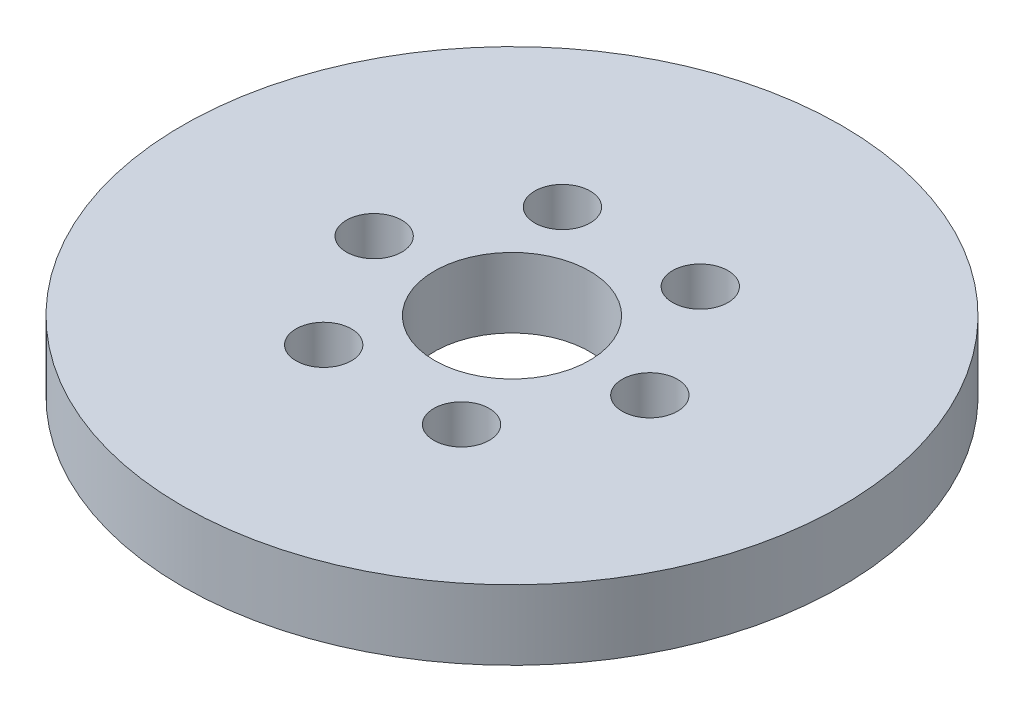
ISO-10303-21;
HEADER;
FILE_DESCRIPTION(('STEP AP214'),'2;1');
FILE_NAME('part.step','',(''),(''),'','','');
FILE_SCHEMA(('AUTOMOTIVE_DESIGN { 1 0 10303 214 1 1 1 1 }'));
ENDSEC;
DATA;
#1=APPLICATION_CONTEXT('core data for automotive mechanical design processes');
#2=APPLICATION_PROTOCOL_DEFINITION('international standard','automotive_design',2000,#1);
#3=PRODUCT_CONTEXT('',#1,'mechanical');
#4=PRODUCT('Part','Part','',(#3));
#5=PRODUCT_RELATED_PRODUCT_CATEGORY('part','',(#4));
#6=PRODUCT_DEFINITION_FORMATION('','',#4);
#7=PRODUCT_DEFINITION_CONTEXT('part definition',#1,'design');
#8=PRODUCT_DEFINITION('design','',#6,#7);
#9=PRODUCT_DEFINITION_SHAPE('','',#8);
#10=(LENGTH_UNIT() NAMED_UNIT(*) SI_UNIT(.MILLI.,.METRE.));
#11=(NAMED_UNIT(*) PLANE_ANGLE_UNIT() SI_UNIT($,.RADIAN.));
#12=(NAMED_UNIT(*) SI_UNIT($,.STERADIAN.) SOLID_ANGLE_UNIT());
#13=UNCERTAINTY_MEASURE_WITH_UNIT(LENGTH_MEASURE(1.E-05),#10,'distance_accuracy_value','');
#14=(GEOMETRIC_REPRESENTATION_CONTEXT(3) GLOBAL_UNCERTAINTY_ASSIGNED_CONTEXT((#13)) GLOBAL_UNIT_ASSIGNED_CONTEXT((#10,
#11,#12)) REPRESENTATION_CONTEXT('',''));
#15=CARTESIAN_POINT('',(0.,0.,0.));
#16=DIRECTION('',(0.,0.,1.));
#17=DIRECTION('',(1.,0.,0.));
#18=AXIS2_PLACEMENT_3D('',#15,#16,#17);
#19=CARTESIAN_POINT('',(0.,18.,0.));
#20=DIRECTION('',(0.,-1.,0.));
#21=DIRECTION('',(0.,0.,-1.));
#22=AXIS2_PLACEMENT_3D('',#19,#20,#21);
#23=CYLINDRICAL_SURFACE('',#22,85.);
#24=CARTESIAN_POINT('',(0.,18.,0.));
#25=DIRECTION('',(0.,1.,0.));
#26=DIRECTION('',(0.,0.,1.));
#27=AXIS2_PLACEMENT_3D('',#24,#25,#26);
#28=CIRCLE('',#27,85.);
#29=CARTESIAN_POINT('',(0.,18.,85.));
#30=VERTEX_POINT('',#29);
#31=EDGE_CURVE('E10',#30,#30,#28,.T.);
#32=ORIENTED_EDGE('',*,*,#31,.F.);
#33=EDGE_LOOP('',(#32));
#34=FACE_BOUND('',#33,.T.);
#35=CARTESIAN_POINT('',(0.,0.,0.));
#36=DIRECTION('',(0.,1.,0.));
#37=DIRECTION('',(0.,0.,1.));
#38=AXIS2_PLACEMENT_3D('',#35,#36,#37);
#39=CIRCLE('',#38,85.);
#40=CARTESIAN_POINT('',(0.,0.,85.));
#41=VERTEX_POINT('',#40);
#42=EDGE_CURVE('E37',#41,#41,#39,.T.);
#43=ORIENTED_EDGE('',*,*,#42,.T.);
#44=EDGE_LOOP('',(#43));
#45=FACE_BOUND('',#44,.T.);
#46=ADVANCED_FACE('F40',(#34,#45),#23,.T.);
#47=CARTESIAN_POINT('',(0.,18.,0.));
#48=DIRECTION('',(0.,1.,0.));
#49=DIRECTION('',(0.,0.,1.));
#50=AXIS2_PLACEMENT_3D('',#47,#48,#49);
#51=PLANE('',#50);
#52=CARTESIAN_POINT('',(-17.7756832143866,18.,-30.788386466566));
#53=DIRECTION('',(0.,1.,0.));
#54=DIRECTION('',(-0.866025403784433,0.,0.50000000000001));
#55=AXIS2_PLACEMENT_3D('',#52,#53,#54);
#56=CIRCLE('',#55,7.14801269062768);
#57=CARTESIAN_POINT('',(-17.7756832143866,18.,-23.6403737759383));
#58=VERTEX_POINT('',#57);
#59=EDGE_CURVE('E70',#58,#58,#56,.T.);
#60=ORIENTED_EDGE('',*,*,#59,.F.);
#61=EDGE_LOOP('',(#60));
#62=FACE_BOUND('',#61,.T.);
#63=CARTESIAN_POINT('',(17.775683214386,18.,-30.7883864665664));
#64=DIRECTION('',(0.,1.,0.));
#65=DIRECTION('',(-0.866025403784443,0.,-0.499999999999992));
#66=AXIS2_PLACEMENT_3D('',#63,#64,#65);
#67=CIRCLE('',#66,7.14801269062768);
#68=CARTESIAN_POINT('',(17.775683214386,18.,-23.6403737759387));
#69=VERTEX_POINT('',#68);
#70=EDGE_CURVE('E71',#69,#69,#67,.T.);
#71=ORIENTED_EDGE('',*,*,#70,.F.);
#72=EDGE_LOOP('',(#71));
#73=FACE_BOUND('',#72,.T.);
#74=CARTESIAN_POINT('',(35.5513664287725,18.,0.));
#75=DIRECTION('',(0.,1.,0.));
#76=DIRECTION('',(0.,0.,-1.));
#77=AXIS2_PLACEMENT_3D('',#74,#75,#76);
#78=CIRCLE('',#77,7.14801269062768);
#79=CARTESIAN_POINT('',(35.5513664287725,18.,7.14801269062768));
#80=VERTEX_POINT('',#79);
#81=EDGE_CURVE('E78',#80,#80,#78,.T.);
#82=ORIENTED_EDGE('',*,*,#81,.F.);
#83=EDGE_LOOP('',(#82));
#84=FACE_BOUND('',#83,.T.);
#85=CARTESIAN_POINT('',(17.7756832143864,18.,30.7883864665662));
#86=DIRECTION('',(0.,1.,0.));
#87=DIRECTION('',(0.866025403784436,0.,-0.500000000000004));
#88=AXIS2_PLACEMENT_3D('',#85,#86,#87);
#89=CIRCLE('',#88,7.14801269062768);
#90=CARTESIAN_POINT('',(17.7756832143864,18.,37.9363991571938));
#91=VERTEX_POINT('',#90);
#92=EDGE_CURVE('E84',#91,#91,#89,.T.);
#93=ORIENTED_EDGE('',*,*,#92,.F.);
#94=EDGE_LOOP('',(#93));
#95=FACE_BOUND('',#94,.T.);
#96=CARTESIAN_POINT('',(-17.7756832143862,18.,30.7883864665663));
#97=DIRECTION('',(0.,1.,0.));
#98=DIRECTION('',(0.86602540378444,0.,0.499999999999998));
#99=AXIS2_PLACEMENT_3D('',#96,#97,#98);
#100=CIRCLE('',#99,7.14801269062768);
#101=CARTESIAN_POINT('',(-17.7756832143862,18.,37.9363991571939));
#102=VERTEX_POINT('',#101);
#103=EDGE_CURVE('E61',#102,#102,#100,.T.);
#104=ORIENTED_EDGE('',*,*,#103,.F.);
#105=EDGE_LOOP('',(#104));
#106=FACE_BOUND('',#105,.T.);
#107=CARTESIAN_POINT('',(-35.5513664287725,18.,0.));
#108=DIRECTION('',(0.,1.,0.));
#109=DIRECTION('',(0.,0.,1.));
#110=AXIS2_PLACEMENT_3D('',#107,#108,#109);
#111=CIRCLE('',#110,7.14801269062768);
#112=CARTESIAN_POINT('',(-35.5513664287725,18.,7.14801269062768));
#113=VERTEX_POINT('',#112);
#114=EDGE_CURVE('E54',#113,#113,#111,.T.);
#115=ORIENTED_EDGE('',*,*,#114,.F.);
#116=EDGE_LOOP('',(#115));
#117=FACE_BOUND('',#116,.T.);
#118=CARTESIAN_POINT('',(0.,18.,0.));
#119=DIRECTION('',(0.,1.,0.));
#120=DIRECTION('',(0.,0.,1.));
#121=AXIS2_PLACEMENT_3D('',#118,#119,#120);
#122=CIRCLE('',#121,20.);
#123=CARTESIAN_POINT('',(0.,18.,20.));
#124=VERTEX_POINT('',#123);
#125=EDGE_CURVE('E50',#124,#124,#122,.T.);
#126=ORIENTED_EDGE('',*,*,#125,.F.);
#127=EDGE_LOOP('',(#126));
#128=FACE_BOUND('',#127,.T.);
#129=ORIENTED_EDGE('',*,*,#31,.T.);
#130=EDGE_LOOP('',(#129));
#131=FACE_BOUND('',#130,.T.);
#132=ADVANCED_FACE('F99',(#62,#73,#84,#95,#106,#117,#128,#131),#51,.T.);
#133=CARTESIAN_POINT('',(0.,0.,0.));
#134=DIRECTION('',(0.,1.,0.));
#135=DIRECTION('',(0.,0.,1.));
#136=AXIS2_PLACEMENT_3D('',#133,#134,#135);
#137=PLANE('',#136);
#138=CARTESIAN_POINT('',(0.,0.,0.));
#139=DIRECTION('',(0.,1.,0.));
#140=DIRECTION('',(0.,0.,1.));
#141=AXIS2_PLACEMENT_3D('',#138,#139,#140);
#142=CIRCLE('',#141,20.);
#143=CARTESIAN_POINT('',(0.,0.,20.));
#144=VERTEX_POINT('',#143);
#145=EDGE_CURVE('E47',#144,#144,#142,.T.);
#146=ORIENTED_EDGE('',*,*,#145,.T.);
#147=EDGE_LOOP('',(#146));
#148=FACE_BOUND('',#147,.T.);
#149=ORIENTED_EDGE('',*,*,#42,.F.);
#150=EDGE_LOOP('',(#149));
#151=FACE_BOUND('',#150,.T.);
#152=ADVANCED_FACE('F103',(#148,#151),#137,.F.);
#153=CARTESIAN_POINT('',(0.,18.,0.));
#154=DIRECTION('',(0.,-1.,0.));
#155=DIRECTION('',(0.,0.,-1.));
#156=AXIS2_PLACEMENT_3D('',#153,#154,#155);
#157=CYLINDRICAL_SURFACE('',#156,20.);
#158=ORIENTED_EDGE('',*,*,#125,.T.);
#159=EDGE_LOOP('',(#158));
#160=FACE_BOUND('',#159,.T.);
#161=ORIENTED_EDGE('',*,*,#145,.F.);
#162=EDGE_LOOP('',(#161));
#163=FACE_BOUND('',#162,.T.);
#164=ADVANCED_FACE('F115',(#160,#163),#157,.F.);
#165=CARTESIAN_POINT('',(-35.5513664287725,3.68480054007321,0.));
#166=DIRECTION('',(0.,1.,0.));
#167=DIRECTION('',(0.,0.,1.));
#168=AXIS2_PLACEMENT_3D('',#165,#166,#167);
#169=CYLINDRICAL_SURFACE('',#168,7.14801269062768);
#170=CARTESIAN_POINT('',(-35.5513664287725,3.68480054007321,0.));
#171=DIRECTION('',(0.,1.,0.));
#172=DIRECTION('',(0.,0.,1.));
#173=AXIS2_PLACEMENT_3D('',#170,#171,#172);
#174=CIRCLE('',#173,7.14801269062768);
#175=CARTESIAN_POINT('',(-35.5513664287725,3.68480054007321,7.14801269062768));
#176=VERTEX_POINT('',#175);
#177=EDGE_CURVE('E55',#176,#176,#174,.T.);
#178=CARTESIAN_POINT('',(-35.5513664287725,3.68480054007321,7.14801269062768));
#179=CARTESIAN_POINT('',(-35.5513664287725,3.83391720111411,7.14801269062768));
#180=CARTESIAN_POINT('',(-35.5513664287725,3.98303386215502,7.14801269062768));
#181=CARTESIAN_POINT('',(-35.5513664287725,4.28126718423683,7.14801269062768));
#182=CARTESIAN_POINT('',(-35.5513664287725,4.43038384527773,7.14801269062768));
#183=CARTESIAN_POINT('',(-35.5513664287725,4.72861716735954,7.14801269062768));
#184=CARTESIAN_POINT('',(-35.5513664287725,4.87773382840044,7.14801269062768));
#185=CARTESIAN_POINT('',(-35.5513664287725,5.17596715048225,7.14801269062768));
#186=CARTESIAN_POINT('',(-35.5513664287725,5.32508381152315,7.14801269062768));
#187=CARTESIAN_POINT('',(-35.5513664287725,5.62331713360496,7.14801269062768));
#188=CARTESIAN_POINT('',(-35.5513664287725,5.77243379464587,7.14801269062768));
#189=CARTESIAN_POINT('',(-35.5513664287725,6.07066711672767,7.14801269062768));
#190=CARTESIAN_POINT('',(-35.5513664287725,6.21978377776858,7.14801269062768));
#191=CARTESIAN_POINT('',(-35.5513664287725,6.51801709985039,7.14801269062768));
#192=CARTESIAN_POINT('',(-35.5513664287725,6.66713376089129,7.14801269062768));
#193=CARTESIAN_POINT('',(-35.5513664287725,6.9653670829731,7.14801269062768));
#194=CARTESIAN_POINT('',(-35.5513664287725,7.114483744014,7.14801269062768));
#195=CARTESIAN_POINT('',(-35.5513664287725,7.41271706609581,7.14801269062768));
#196=CARTESIAN_POINT('',(-35.5513664287725,7.56183372713672,7.14801269062768));
#197=CARTESIAN_POINT('',(-35.5513664287725,7.86006704921852,7.14801269062768));
#198=CARTESIAN_POINT('',(-35.5513664287725,8.00918371025943,7.14801269062768));
#199=CARTESIAN_POINT('',(-35.5513664287725,8.30741703234123,7.14801269062768));
#200=CARTESIAN_POINT('',(-35.5513664287725,8.45653369338214,7.14801269062768));
#201=CARTESIAN_POINT('',(-35.5513664287725,8.75476701546395,7.14801269062768));
#202=CARTESIAN_POINT('',(-35.5513664287725,8.90388367650485,7.14801269062768));
#203=CARTESIAN_POINT('',(-35.5513664287725,9.20211699858666,7.14801269062768));
#204=CARTESIAN_POINT('',(-35.5513664287725,9.35123365962756,7.14801269062768));
#205=CARTESIAN_POINT('',(-35.5513664287725,9.64946698170937,7.14801269062768));
#206=CARTESIAN_POINT('',(-35.5513664287725,9.79858364275028,7.14801269062768));
#207=CARTESIAN_POINT('',(-35.5513664287725,10.0968169648321,7.14801269062768));
#208=CARTESIAN_POINT('',(-35.5513664287725,10.245933625873,7.14801269062768));
#209=CARTESIAN_POINT('',(-35.5513664287725,10.5441669479548,7.14801269062768));
#210=CARTESIAN_POINT('',(-35.5513664287725,10.6932836089957,7.14801269062768));
#211=CARTESIAN_POINT('',(-35.5513664287725,10.9915169310775,7.14801269062768));
#212=CARTESIAN_POINT('',(-35.5513664287725,11.1406335921184,7.14801269062768));
#213=CARTESIAN_POINT('',(-35.5513664287725,11.4388669142002,7.14801269062768));
#214=CARTESIAN_POINT('',(-35.5513664287725,11.5879835752411,7.14801269062768));
#215=CARTESIAN_POINT('',(-35.5513664287725,11.8862168973229,7.14801269062768));
#216=CARTESIAN_POINT('',(-35.5513664287725,12.0353335583638,7.14801269062768));
#217=CARTESIAN_POINT('',(-35.5513664287725,12.3335668804456,7.14801269062768));
#218=CARTESIAN_POINT('',(-35.5513664287725,12.4826835414865,7.14801269062768));
#219=CARTESIAN_POINT('',(-35.5513664287725,12.7809168635684,7.14801269062768));
#220=CARTESIAN_POINT('',(-35.5513664287725,12.9300335246093,7.14801269062768));
#221=CARTESIAN_POINT('',(-35.5513664287725,13.2282668466911,7.14801269062768));
#222=CARTESIAN_POINT('',(-35.5513664287725,13.377383507732,7.14801269062768));
#223=CARTESIAN_POINT('',(-35.5513664287725,13.6756168298138,7.14801269062768));
#224=CARTESIAN_POINT('',(-35.5513664287725,13.8247334908547,7.14801269062768));
#225=CARTESIAN_POINT('',(-35.5513664287725,14.1229668129365,7.14801269062768));
#226=CARTESIAN_POINT('',(-35.5513664287725,14.2720834739774,7.14801269062768));
#227=CARTESIAN_POINT('',(-35.5513664287725,14.5703167960592,7.14801269062768));
#228=CARTESIAN_POINT('',(-35.5513664287725,14.7194334571001,7.14801269062768));
#229=CARTESIAN_POINT('',(-35.5513664287725,15.0176667791819,7.14801269062768));
#230=CARTESIAN_POINT('',(-35.5513664287725,15.1667834402228,7.14801269062768));
#231=CARTESIAN_POINT('',(-35.5513664287725,15.4650167623046,7.14801269062768));
#232=CARTESIAN_POINT('',(-35.5513664287725,15.6141334233455,7.14801269062768));
#233=CARTESIAN_POINT('',(-35.5513664287725,15.9123667454273,7.14801269062768));
#234=CARTESIAN_POINT('',(-35.5513664287725,16.0614834064682,7.14801269062768));
#235=CARTESIAN_POINT('',(-35.5513664287725,16.3597167285501,7.14801269062768));
#236=CARTESIAN_POINT('',(-35.5513664287725,16.508833389591,7.14801269062768));
#237=CARTESIAN_POINT('',(-35.5513664287725,16.8070667116728,7.14801269062768));
#238=CARTESIAN_POINT('',(-35.5513664287725,16.9561833727137,7.14801269062768));
#239=CARTESIAN_POINT('',(-35.5513664287725,17.2544166947955,7.14801269062768));
#240=CARTESIAN_POINT('',(-35.5513664287725,17.4035333558364,7.14801269062768));
#241=CARTESIAN_POINT('',(-35.5513664287725,17.7017666779182,7.14801269062768));
#242=CARTESIAN_POINT('',(-35.5513664287725,17.8508833389591,7.14801269062768));
#243=CARTESIAN_POINT('',(-35.5513664287725,18.,7.14801269062768));
#244=B_SPLINE_CURVE_WITH_KNOTS('',3,(#178,#179,#180,#181,#182,#183,#184,#185,#186,#187,#188,
#189,#190,#191,#192,#193,#194,#195,#196,#197,#198,#199,#200,#201,#202,#203,#204,#205,#206,#207,
#208,#209,#210,#211,#212,#213,#214,#215,#216,#217,#218,#219,#220,#221,#222,#223,#224,#225,#226,
#227,#228,#229,#230,#231,#232,#233,#234,#235,#236,#237,#238,#239,#240,#241,#242,#243),
.UNSPECIFIED.,.F.,.F.,(4,2,2,2,2,2,2,2,2,2,2,2,2,2,2,2,2,2,2,2,2,2,2,2,2,2,2,2,2,2,2,2,4),(0.,
0.447349983122712,0.894699966245424,1.34204994936814,1.78939993249085,2.23674991561356,
2.68409989873627,3.13144988185898,3.5787998649817,4.02614984810441,4.47349983122712,
4.92084981434983,5.36819979747254,5.81554978059526,6.26289976371797,6.71024974684068,
7.15759972996339,7.60494971308611,8.05229969620882,8.49964967933153,8.94699966245424,
9.39434964557695,9.84169962869967,10.2890496118224,10.7363995949451,11.1837495780678,
11.6310995611905,12.0784495443132,12.5257995274359,12.9731495105587,13.4204994936814,
13.8678494768041,14.3151994599268),.UNSPECIFIED.);
#245=EDGE_CURVE('BSEAM113',#176,#113,#244,.T.);
#246=ORIENTED_EDGE('',*,*,#177,.F.);
#247=ORIENTED_EDGE('',*,*,#114,.T.);
#248=ORIENTED_EDGE('',*,*,#245,.T.);
#249=ORIENTED_EDGE('',*,*,#245,.F.);
#250=EDGE_LOOP('',(#246,#248,#247,#249));
#251=FACE_BOUND('',#250,.T.);
#252=ADVANCED_FACE('F113',(#251),#169,.F.);
#253=CARTESIAN_POINT('',(-35.5513664287725,3.68480054007321,0.));
#254=DIRECTION('',(0.,1.,0.));
#255=DIRECTION('',(0.,0.,1.));
#256=AXIS2_PLACEMENT_3D('',#253,#254,#255);
#257=PLANE('',#256);
#258=ORIENTED_EDGE('',*,*,#177,.T.);
#259=EDGE_LOOP('',(#258));
#260=FACE_BOUND('',#259,.T.);
#261=ADVANCED_FACE('F144',(#260),#257,.T.);
#262=CARTESIAN_POINT('',(-17.7756832143862,3.68480054007321,30.7883864665663));
#263=DIRECTION('',(0.,1.,0.));
#264=DIRECTION('',(0.,0.,1.));
#265=AXIS2_PLACEMENT_3D('',#262,#263,#264);
#266=CYLINDRICAL_SURFACE('',#265,7.14801269062768);
#267=CARTESIAN_POINT('',(-17.7756832143862,3.68480054007321,30.7883864665663));
#268=DIRECTION('',(0.,1.,0.));
#269=DIRECTION('',(0.86602540378444,0.,0.499999999999998));
#270=AXIS2_PLACEMENT_3D('',#267,#268,#269);
#271=CIRCLE('',#270,7.14801269062768);
#272=CARTESIAN_POINT('',(-17.7756832143862,3.68480054007321,37.9363991571939));
#273=VERTEX_POINT('',#272);
#274=EDGE_CURVE('E59',#273,#273,#271,.T.);
#275=CARTESIAN_POINT('',(-17.7756832143862,3.68480054007321,37.9363991571939));
#276=CARTESIAN_POINT('',(-17.7756832143862,3.83391720111411,37.9363991571939));
#277=CARTESIAN_POINT('',(-17.7756832143862,3.98303386215502,37.9363991571939));
#278=CARTESIAN_POINT('',(-17.7756832143862,4.28126718423683,37.9363991571939));
#279=CARTESIAN_POINT('',(-17.7756832143862,4.43038384527773,37.9363991571939));
#280=CARTESIAN_POINT('',(-17.7756832143862,4.72861716735954,37.9363991571939));
#281=CARTESIAN_POINT('',(-17.7756832143862,4.87773382840044,37.9363991571939));
#282=CARTESIAN_POINT('',(-17.7756832143862,5.17596715048225,37.9363991571939));
#283=CARTESIAN_POINT('',(-17.7756832143862,5.32508381152315,37.9363991571939));
#284=CARTESIAN_POINT('',(-17.7756832143862,5.62331713360496,37.9363991571939));
#285=CARTESIAN_POINT('',(-17.7756832143862,5.77243379464587,37.9363991571939));
#286=CARTESIAN_POINT('',(-17.7756832143862,6.07066711672767,37.9363991571939));
#287=CARTESIAN_POINT('',(-17.7756832143862,6.21978377776858,37.9363991571939));
#288=CARTESIAN_POINT('',(-17.7756832143862,6.51801709985039,37.9363991571939));
#289=CARTESIAN_POINT('',(-17.7756832143862,6.66713376089129,37.9363991571939));
#290=CARTESIAN_POINT('',(-17.7756832143862,6.9653670829731,37.9363991571939));
#291=CARTESIAN_POINT('',(-17.7756832143862,7.114483744014,37.9363991571939));
#292=CARTESIAN_POINT('',(-17.7756832143862,7.41271706609581,37.9363991571939));
#293=CARTESIAN_POINT('',(-17.7756832143862,7.56183372713672,37.9363991571939));
#294=CARTESIAN_POINT('',(-17.7756832143862,7.86006704921852,37.9363991571939));
#295=CARTESIAN_POINT('',(-17.7756832143862,8.00918371025943,37.9363991571939));
#296=CARTESIAN_POINT('',(-17.7756832143862,8.30741703234123,37.9363991571939));
#297=CARTESIAN_POINT('',(-17.7756832143862,8.45653369338214,37.9363991571939));
#298=CARTESIAN_POINT('',(-17.7756832143862,8.75476701546395,37.9363991571939));
#299=CARTESIAN_POINT('',(-17.7756832143862,8.90388367650485,37.9363991571939));
#300=CARTESIAN_POINT('',(-17.7756832143862,9.20211699858666,37.9363991571939));
#301=CARTESIAN_POINT('',(-17.7756832143862,9.35123365962756,37.9363991571939));
#302=CARTESIAN_POINT('',(-17.7756832143862,9.64946698170937,37.9363991571939));
#303=CARTESIAN_POINT('',(-17.7756832143862,9.79858364275028,37.9363991571939));
#304=CARTESIAN_POINT('',(-17.7756832143862,10.0968169648321,37.9363991571939));
#305=CARTESIAN_POINT('',(-17.7756832143862,10.245933625873,37.9363991571939));
#306=CARTESIAN_POINT('',(-17.7756832143862,10.5441669479548,37.9363991571939));
#307=CARTESIAN_POINT('',(-17.7756832143862,10.6932836089957,37.9363991571939));
#308=CARTESIAN_POINT('',(-17.7756832143862,10.9915169310775,37.9363991571939));
#309=CARTESIAN_POINT('',(-17.7756832143862,11.1406335921184,37.9363991571939));
#310=CARTESIAN_POINT('',(-17.7756832143862,11.4388669142002,37.9363991571939));
#311=CARTESIAN_POINT('',(-17.7756832143862,11.5879835752411,37.9363991571939));
#312=CARTESIAN_POINT('',(-17.7756832143862,11.8862168973229,37.9363991571939));
#313=CARTESIAN_POINT('',(-17.7756832143862,12.0353335583638,37.9363991571939));
#314=CARTESIAN_POINT('',(-17.7756832143862,12.3335668804456,37.9363991571939));
#315=CARTESIAN_POINT('',(-17.7756832143862,12.4826835414865,37.9363991571939));
#316=CARTESIAN_POINT('',(-17.7756832143862,12.7809168635684,37.9363991571939));
#317=CARTESIAN_POINT('',(-17.7756832143862,12.9300335246093,37.9363991571939));
#318=CARTESIAN_POINT('',(-17.7756832143862,13.2282668466911,37.9363991571939));
#319=CARTESIAN_POINT('',(-17.7756832143862,13.377383507732,37.9363991571939));
#320=CARTESIAN_POINT('',(-17.7756832143862,13.6756168298138,37.9363991571939));
#321=CARTESIAN_POINT('',(-17.7756832143862,13.8247334908547,37.9363991571939));
#322=CARTESIAN_POINT('',(-17.7756832143862,14.1229668129365,37.9363991571939));
#323=CARTESIAN_POINT('',(-17.7756832143862,14.2720834739774,37.9363991571939));
#324=CARTESIAN_POINT('',(-17.7756832143862,14.5703167960592,37.9363991571939));
#325=CARTESIAN_POINT('',(-17.7756832143862,14.7194334571001,37.9363991571939));
#326=CARTESIAN_POINT('',(-17.7756832143862,15.0176667791819,37.9363991571939));
#327=CARTESIAN_POINT('',(-17.7756832143862,15.1667834402228,37.9363991571939));
#328=CARTESIAN_POINT('',(-17.7756832143862,15.4650167623046,37.9363991571939));
#329=CARTESIAN_POINT('',(-17.7756832143862,15.6141334233455,37.9363991571939));
#330=CARTESIAN_POINT('',(-17.7756832143862,15.9123667454273,37.9363991571939));
#331=CARTESIAN_POINT('',(-17.7756832143862,16.0614834064682,37.9363991571939));
#332=CARTESIAN_POINT('',(-17.7756832143862,16.3597167285501,37.9363991571939));
#333=CARTESIAN_POINT('',(-17.7756832143862,16.508833389591,37.9363991571939));
#334=CARTESIAN_POINT('',(-17.7756832143862,16.8070667116728,37.9363991571939));
#335=CARTESIAN_POINT('',(-17.7756832143862,16.9561833727137,37.9363991571939));
#336=CARTESIAN_POINT('',(-17.7756832143862,17.2544166947955,37.9363991571939));
#337=CARTESIAN_POINT('',(-17.7756832143862,17.4035333558364,37.9363991571939));
#338=CARTESIAN_POINT('',(-17.7756832143862,17.7017666779182,37.9363991571939));
#339=CARTESIAN_POINT('',(-17.7756832143862,17.8508833389591,37.9363991571939));
#340=CARTESIAN_POINT('',(-17.7756832143862,18.,37.9363991571939));
#341=B_SPLINE_CURVE_WITH_KNOTS('',3,(#275,#276,#277,#278,#279,#280,#281,#282,#283,#284,#285,
#286,#287,#288,#289,#290,#291,#292,#293,#294,#295,#296,#297,#298,#299,#300,#301,#302,#303,#304,
#305,#306,#307,#308,#309,#310,#311,#312,#313,#314,#315,#316,#317,#318,#319,#320,#321,#322,#323,
#324,#325,#326,#327,#328,#329,#330,#331,#332,#333,#334,#335,#336,#337,#338,#339,#340),
.UNSPECIFIED.,.F.,.F.,(4,2,2,2,2,2,2,2,2,2,2,2,2,2,2,2,2,2,2,2,2,2,2,2,2,2,2,2,2,2,2,2,4),(0.,
0.447349983122712,0.894699966245424,1.34204994936814,1.78939993249085,2.23674991561356,
2.68409989873627,3.13144988185898,3.5787998649817,4.02614984810441,4.47349983122712,
4.92084981434983,5.36819979747254,5.81554978059526,6.26289976371797,6.71024974684068,
7.15759972996339,7.60494971308611,8.05229969620882,8.49964967933153,8.94699966245424,
9.39434964557695,9.84169962869967,10.2890496118224,10.7363995949451,11.1837495780678,
11.6310995611905,12.0784495443132,12.5257995274359,12.9731495105587,13.4204994936814,
13.8678494768041,14.3151994599268),.UNSPECIFIED.);
#342=EDGE_CURVE('BSEAM153',#273,#102,#341,.T.);
#343=ORIENTED_EDGE('',*,*,#274,.F.);
#344=ORIENTED_EDGE('',*,*,#103,.T.);
#345=ORIENTED_EDGE('',*,*,#342,.T.);
#346=ORIENTED_EDGE('',*,*,#342,.F.);
#347=EDGE_LOOP('',(#343,#345,#344,#346));
#348=FACE_BOUND('',#347,.T.);
#349=ADVANCED_FACE('F153',(#348),#266,.F.);
#350=CARTESIAN_POINT('',(-17.7756832143862,3.68480054007321,30.7883864665663));
#351=DIRECTION('',(0.,1.,0.));
#352=DIRECTION('',(0.86602540378444,0.,0.499999999999998));
#353=AXIS2_PLACEMENT_3D('',#350,#351,#352);
#354=PLANE('',#353);
#355=ORIENTED_EDGE('',*,*,#274,.T.);
#356=EDGE_LOOP('',(#355));
#357=FACE_BOUND('',#356,.T.);
#358=ADVANCED_FACE('F96',(#357),#354,.T.);
#359=CARTESIAN_POINT('',(17.7756832143864,3.68480054007321,30.7883864665662));
#360=DIRECTION('',(0.,1.,0.));
#361=DIRECTION('',(0.,0.,1.));
#362=AXIS2_PLACEMENT_3D('',#359,#360,#361);
#363=CYLINDRICAL_SURFACE('',#362,7.14801269062768);
#364=CARTESIAN_POINT('',(17.7756832143864,3.68480054007321,30.7883864665662));
#365=DIRECTION('',(0.,1.,0.));
#366=DIRECTION('',(0.866025403784436,0.,-0.500000000000004));
#367=AXIS2_PLACEMENT_3D('',#364,#365,#366);
#368=CIRCLE('',#367,7.14801269062768);
#369=CARTESIAN_POINT('',(17.7756832143864,3.68480054007321,37.9363991571938));
#370=VERTEX_POINT('',#369);
#371=EDGE_CURVE('E63',#370,#370,#368,.T.);
#372=CARTESIAN_POINT('',(17.7756832143864,3.68480054007321,37.9363991571938));
#373=CARTESIAN_POINT('',(17.7756832143864,3.83391720111411,37.9363991571938));
#374=CARTESIAN_POINT('',(17.7756832143864,3.98303386215502,37.9363991571938));
#375=CARTESIAN_POINT('',(17.7756832143864,4.28126718423683,37.9363991571938));
#376=CARTESIAN_POINT('',(17.7756832143864,4.43038384527773,37.9363991571938));
#377=CARTESIAN_POINT('',(17.7756832143864,4.72861716735954,37.9363991571938));
#378=CARTESIAN_POINT('',(17.7756832143864,4.87773382840044,37.9363991571938));
#379=CARTESIAN_POINT('',(17.7756832143864,5.17596715048225,37.9363991571938));
#380=CARTESIAN_POINT('',(17.7756832143864,5.32508381152315,37.9363991571938));
#381=CARTESIAN_POINT('',(17.7756832143864,5.62331713360496,37.9363991571938));
#382=CARTESIAN_POINT('',(17.7756832143864,5.77243379464587,37.9363991571938));
#383=CARTESIAN_POINT('',(17.7756832143864,6.07066711672767,37.9363991571938));
#384=CARTESIAN_POINT('',(17.7756832143864,6.21978377776858,37.9363991571938));
#385=CARTESIAN_POINT('',(17.7756832143864,6.51801709985039,37.9363991571938));
#386=CARTESIAN_POINT('',(17.7756832143864,6.66713376089129,37.9363991571938));
#387=CARTESIAN_POINT('',(17.7756832143864,6.9653670829731,37.9363991571938));
#388=CARTESIAN_POINT('',(17.7756832143864,7.114483744014,37.9363991571938));
#389=CARTESIAN_POINT('',(17.7756832143864,7.41271706609581,37.9363991571938));
#390=CARTESIAN_POINT('',(17.7756832143864,7.56183372713672,37.9363991571938));
#391=CARTESIAN_POINT('',(17.7756832143864,7.86006704921852,37.9363991571938));
#392=CARTESIAN_POINT('',(17.7756832143864,8.00918371025943,37.9363991571938));
#393=CARTESIAN_POINT('',(17.7756832143864,8.30741703234123,37.9363991571938));
#394=CARTESIAN_POINT('',(17.7756832143864,8.45653369338214,37.9363991571938));
#395=CARTESIAN_POINT('',(17.7756832143864,8.75476701546395,37.9363991571938));
#396=CARTESIAN_POINT('',(17.7756832143864,8.90388367650485,37.9363991571938));
#397=CARTESIAN_POINT('',(17.7756832143864,9.20211699858666,37.9363991571938));
#398=CARTESIAN_POINT('',(17.7756832143864,9.35123365962756,37.9363991571938));
#399=CARTESIAN_POINT('',(17.7756832143864,9.64946698170937,37.9363991571938));
#400=CARTESIAN_POINT('',(17.7756832143864,9.79858364275028,37.9363991571938));
#401=CARTESIAN_POINT('',(17.7756832143864,10.0968169648321,37.9363991571938));
#402=CARTESIAN_POINT('',(17.7756832143864,10.245933625873,37.9363991571938));
#403=CARTESIAN_POINT('',(17.7756832143864,10.5441669479548,37.9363991571938));
#404=CARTESIAN_POINT('',(17.7756832143864,10.6932836089957,37.9363991571938));
#405=CARTESIAN_POINT('',(17.7756832143864,10.9915169310775,37.9363991571938));
#406=CARTESIAN_POINT('',(17.7756832143864,11.1406335921184,37.9363991571938));
#407=CARTESIAN_POINT('',(17.7756832143864,11.4388669142002,37.9363991571938));
#408=CARTESIAN_POINT('',(17.7756832143864,11.5879835752411,37.9363991571938));
#409=CARTESIAN_POINT('',(17.7756832143864,11.8862168973229,37.9363991571938));
#410=CARTESIAN_POINT('',(17.7756832143864,12.0353335583638,37.9363991571938));
#411=CARTESIAN_POINT('',(17.7756832143864,12.3335668804456,37.9363991571938));
#412=CARTESIAN_POINT('',(17.7756832143864,12.4826835414865,37.9363991571938));
#413=CARTESIAN_POINT('',(17.7756832143864,12.7809168635684,37.9363991571938));
#414=CARTESIAN_POINT('',(17.7756832143864,12.9300335246093,37.9363991571938));
#415=CARTESIAN_POINT('',(17.7756832143864,13.2282668466911,37.9363991571938));
#416=CARTESIAN_POINT('',(17.7756832143864,13.377383507732,37.9363991571938));
#417=CARTESIAN_POINT('',(17.7756832143864,13.6756168298138,37.9363991571938));
#418=CARTESIAN_POINT('',(17.7756832143864,13.8247334908547,37.9363991571938));
#419=CARTESIAN_POINT('',(17.7756832143864,14.1229668129365,37.9363991571938));
#420=CARTESIAN_POINT('',(17.7756832143864,14.2720834739774,37.9363991571938));
#421=CARTESIAN_POINT('',(17.7756832143864,14.5703167960592,37.9363991571938));
#422=CARTESIAN_POINT('',(17.7756832143864,14.7194334571001,37.9363991571938));
#423=CARTESIAN_POINT('',(17.7756832143864,15.0176667791819,37.9363991571938));
#424=CARTESIAN_POINT('',(17.7756832143864,15.1667834402228,37.9363991571938));
#425=CARTESIAN_POINT('',(17.7756832143864,15.4650167623046,37.9363991571938));
#426=CARTESIAN_POINT('',(17.7756832143864,15.6141334233455,37.9363991571938));
#427=CARTESIAN_POINT('',(17.7756832143864,15.9123667454273,37.9363991571938));
#428=CARTESIAN_POINT('',(17.7756832143864,16.0614834064682,37.9363991571938));
#429=CARTESIAN_POINT('',(17.7756832143864,16.3597167285501,37.9363991571938));
#430=CARTESIAN_POINT('',(17.7756832143864,16.508833389591,37.9363991571938));
#431=CARTESIAN_POINT('',(17.7756832143864,16.8070667116728,37.9363991571938));
#432=CARTESIAN_POINT('',(17.7756832143864,16.9561833727137,37.9363991571938));
#433=CARTESIAN_POINT('',(17.7756832143864,17.2544166947955,37.9363991571938));
#434=CARTESIAN_POINT('',(17.7756832143864,17.4035333558364,37.9363991571938));
#435=CARTESIAN_POINT('',(17.7756832143864,17.7017666779182,37.9363991571938));
#436=CARTESIAN_POINT('',(17.7756832143864,17.8508833389591,37.9363991571938));
#437=CARTESIAN_POINT('',(17.7756832143864,18.,37.9363991571938));
#438=B_SPLINE_CURVE_WITH_KNOTS('',3,(#372,#373,#374,#375,#376,#377,#378,#379,#380,#381,#382,
#383,#384,#385,#386,#387,#388,#389,#390,#391,#392,#393,#394,#395,#396,#397,#398,#399,#400,#401,
#402,#403,#404,#405,#406,#407,#408,#409,#410,#411,#412,#413,#414,#415,#416,#417,#418,#419,#420,
#421,#422,#423,#424,#425,#426,#427,#428,#429,#430,#431,#432,#433,#434,#435,#436,#437),
.UNSPECIFIED.,.F.,.F.,(4,2,2,2,2,2,2,2,2,2,2,2,2,2,2,2,2,2,2,2,2,2,2,2,2,2,2,2,2,2,2,2,4),(0.,
0.447349983122712,0.894699966245424,1.34204994936814,1.78939993249085,2.23674991561356,
2.68409989873627,3.13144988185898,3.5787998649817,4.02614984810441,4.47349983122712,
4.92084981434983,5.36819979747254,5.81554978059526,6.26289976371797,6.71024974684068,
7.15759972996339,7.60494971308611,8.05229969620882,8.49964967933153,8.94699966245424,
9.39434964557695,9.84169962869967,10.2890496118224,10.7363995949451,11.1837495780678,
11.6310995611905,12.0784495443132,12.5257995274359,12.9731495105587,13.4204994936814,
13.8678494768041,14.3151994599268),.UNSPECIFIED.);
#439=EDGE_CURVE('BSEAM91',#370,#91,#438,.T.);
#440=ORIENTED_EDGE('',*,*,#371,.F.);
#441=ORIENTED_EDGE('',*,*,#92,.T.);
#442=ORIENTED_EDGE('',*,*,#439,.T.);
#443=ORIENTED_EDGE('',*,*,#439,.F.);
#444=EDGE_LOOP('',(#440,#442,#441,#443));
#445=FACE_BOUND('',#444,.T.);
#446=ADVANCED_FACE('F91',(#445),#363,.F.);
#447=CARTESIAN_POINT('',(17.7756832143864,3.68480054007321,30.7883864665662));
#448=DIRECTION('',(0.,1.,0.));
#449=DIRECTION('',(0.866025403784436,0.,-0.500000000000004));
#450=AXIS2_PLACEMENT_3D('',#447,#448,#449);
#451=PLANE('',#450);
#452=ORIENTED_EDGE('',*,*,#371,.T.);
#453=EDGE_LOOP('',(#452));
#454=FACE_BOUND('',#453,.T.);
#455=ADVANCED_FACE('F93',(#454),#451,.T.);
#456=CARTESIAN_POINT('',(35.5513664287725,3.68480054007321,0.));
#457=DIRECTION('',(0.,1.,0.));
#458=DIRECTION('',(0.,0.,1.));
#459=AXIS2_PLACEMENT_3D('',#456,#457,#458);
#460=CYLINDRICAL_SURFACE('',#459,7.14801269062768);
#461=CARTESIAN_POINT('',(35.5513664287725,3.68480054007321,0.));
#462=DIRECTION('',(0.,1.,0.));
#463=DIRECTION('',(0.,0.,-1.));
#464=AXIS2_PLACEMENT_3D('',#461,#462,#463);
#465=CIRCLE('',#464,7.14801269062768);
#466=CARTESIAN_POINT('',(35.5513664287725,3.68480054007321,7.14801269062768));
#467=VERTEX_POINT('',#466);
#468=EDGE_CURVE('E85',#467,#467,#465,.T.);
#469=CARTESIAN_POINT('',(35.5513664287725,3.68480054007321,7.14801269062768));
#470=CARTESIAN_POINT('',(35.5513664287725,3.83391720111411,7.14801269062768));
#471=CARTESIAN_POINT('',(35.5513664287725,3.98303386215502,7.14801269062768));
#472=CARTESIAN_POINT('',(35.5513664287725,4.28126718423683,7.14801269062768));
#473=CARTESIAN_POINT('',(35.5513664287725,4.43038384527773,7.14801269062768));
#474=CARTESIAN_POINT('',(35.5513664287725,4.72861716735954,7.14801269062768));
#475=CARTESIAN_POINT('',(35.5513664287725,4.87773382840044,7.14801269062768));
#476=CARTESIAN_POINT('',(35.5513664287725,5.17596715048225,7.14801269062768));
#477=CARTESIAN_POINT('',(35.5513664287725,5.32508381152315,7.14801269062768));
#478=CARTESIAN_POINT('',(35.5513664287725,5.62331713360496,7.14801269062768));
#479=CARTESIAN_POINT('',(35.5513664287725,5.77243379464587,7.14801269062768));
#480=CARTESIAN_POINT('',(35.5513664287725,6.07066711672767,7.14801269062768));
#481=CARTESIAN_POINT('',(35.5513664287725,6.21978377776858,7.14801269062768));
#482=CARTESIAN_POINT('',(35.5513664287725,6.51801709985039,7.14801269062768));
#483=CARTESIAN_POINT('',(35.5513664287725,6.66713376089129,7.14801269062768));
#484=CARTESIAN_POINT('',(35.5513664287725,6.9653670829731,7.14801269062768));
#485=CARTESIAN_POINT('',(35.5513664287725,7.114483744014,7.14801269062768));
#486=CARTESIAN_POINT('',(35.5513664287725,7.41271706609581,7.14801269062768));
#487=CARTESIAN_POINT('',(35.5513664287725,7.56183372713672,7.14801269062768));
#488=CARTESIAN_POINT('',(35.5513664287725,7.86006704921852,7.14801269062768));
#489=CARTESIAN_POINT('',(35.5513664287725,8.00918371025943,7.14801269062768));
#490=CARTESIAN_POINT('',(35.5513664287725,8.30741703234123,7.14801269062768));
#491=CARTESIAN_POINT('',(35.5513664287725,8.45653369338214,7.14801269062768));
#492=CARTESIAN_POINT('',(35.5513664287725,8.75476701546395,7.14801269062768));
#493=CARTESIAN_POINT('',(35.5513664287725,8.90388367650485,7.14801269062768));
#494=CARTESIAN_POINT('',(35.5513664287725,9.20211699858666,7.14801269062768));
#495=CARTESIAN_POINT('',(35.5513664287725,9.35123365962756,7.14801269062768));
#496=CARTESIAN_POINT('',(35.5513664287725,9.64946698170937,7.14801269062768));
#497=CARTESIAN_POINT('',(35.5513664287725,9.79858364275028,7.14801269062768));
#498=CARTESIAN_POINT('',(35.5513664287725,10.0968169648321,7.14801269062768));
#499=CARTESIAN_POINT('',(35.5513664287725,10.245933625873,7.14801269062768));
#500=CARTESIAN_POINT('',(35.5513664287725,10.5441669479548,7.14801269062768));
#501=CARTESIAN_POINT('',(35.5513664287725,10.6932836089957,7.14801269062768));
#502=CARTESIAN_POINT('',(35.5513664287725,10.9915169310775,7.14801269062768));
#503=CARTESIAN_POINT('',(35.5513664287725,11.1406335921184,7.14801269062768));
#504=CARTESIAN_POINT('',(35.5513664287725,11.4388669142002,7.14801269062768));
#505=CARTESIAN_POINT('',(35.5513664287725,11.5879835752411,7.14801269062768));
#506=CARTESIAN_POINT('',(35.5513664287725,11.8862168973229,7.14801269062768));
#507=CARTESIAN_POINT('',(35.5513664287725,12.0353335583638,7.14801269062768));
#508=CARTESIAN_POINT('',(35.5513664287725,12.3335668804456,7.14801269062768));
#509=CARTESIAN_POINT('',(35.5513664287725,12.4826835414865,7.14801269062768));
#510=CARTESIAN_POINT('',(35.5513664287725,12.7809168635684,7.14801269062768));
#511=CARTESIAN_POINT('',(35.5513664287725,12.9300335246093,7.14801269062768));
#512=CARTESIAN_POINT('',(35.5513664287725,13.2282668466911,7.14801269062768));
#513=CARTESIAN_POINT('',(35.5513664287725,13.377383507732,7.14801269062768));
#514=CARTESIAN_POINT('',(35.5513664287725,13.6756168298138,7.14801269062768));
#515=CARTESIAN_POINT('',(35.5513664287725,13.8247334908547,7.14801269062768));
#516=CARTESIAN_POINT('',(35.5513664287725,14.1229668129365,7.14801269062768));
#517=CARTESIAN_POINT('',(35.5513664287725,14.2720834739774,7.14801269062768));
#518=CARTESIAN_POINT('',(35.5513664287725,14.5703167960592,7.14801269062768));
#519=CARTESIAN_POINT('',(35.5513664287725,14.7194334571001,7.14801269062768));
#520=CARTESIAN_POINT('',(35.5513664287725,15.0176667791819,7.14801269062768));
#521=CARTESIAN_POINT('',(35.5513664287725,15.1667834402228,7.14801269062768));
#522=CARTESIAN_POINT('',(35.5513664287725,15.4650167623046,7.14801269062768));
#523=CARTESIAN_POINT('',(35.5513664287725,15.6141334233455,7.14801269062768));
#524=CARTESIAN_POINT('',(35.5513664287725,15.9123667454273,7.14801269062768));
#525=CARTESIAN_POINT('',(35.5513664287725,16.0614834064682,7.14801269062768));
#526=CARTESIAN_POINT('',(35.5513664287725,16.3597167285501,7.14801269062768));
#527=CARTESIAN_POINT('',(35.5513664287725,16.508833389591,7.14801269062768));
#528=CARTESIAN_POINT('',(35.5513664287725,16.8070667116728,7.14801269062768));
#529=CARTESIAN_POINT('',(35.5513664287725,16.9561833727137,7.14801269062768));
#530=CARTESIAN_POINT('',(35.5513664287725,17.2544166947955,7.14801269062768));
#531=CARTESIAN_POINT('',(35.5513664287725,17.4035333558364,7.14801269062768));
#532=CARTESIAN_POINT('',(35.5513664287725,17.7017666779182,7.14801269062768));
#533=CARTESIAN_POINT('',(35.5513664287725,17.8508833389591,7.14801269062768));
#534=CARTESIAN_POINT('',(35.5513664287725,18.,7.14801269062768));
#535=B_SPLINE_CURVE_WITH_KNOTS('',3,(#469,#470,#471,#472,#473,#474,#475,#476,#477,#478,#479,
#480,#481,#482,#483,#484,#485,#486,#487,#488,#489,#490,#491,#492,#493,#494,#495,#496,#497,#498,
#499,#500,#501,#502,#503,#504,#505,#506,#507,#508,#509,#510,#511,#512,#513,#514,#515,#516,#517,
#518,#519,#520,#521,#522,#523,#524,#525,#526,#527,#528,#529,#530,#531,#532,#533,#534),
.UNSPECIFIED.,.F.,.F.,(4,2,2,2,2,2,2,2,2,2,2,2,2,2,2,2,2,2,2,2,2,2,2,2,2,2,2,2,2,2,2,2,4),(0.,
0.447349983122712,0.894699966245424,1.34204994936814,1.78939993249085,2.23674991561356,
2.68409989873627,3.13144988185898,3.5787998649817,4.02614984810441,4.47349983122712,
4.92084981434983,5.36819979747254,5.81554978059526,6.26289976371797,6.71024974684068,
7.15759972996339,7.60494971308611,8.05229969620882,8.49964967933153,8.94699966245424,
9.39434964557695,9.84169962869967,10.2890496118224,10.7363995949451,11.1837495780678,
11.6310995611905,12.0784495443132,12.5257995274359,12.9731495105587,13.4204994936814,
13.8678494768041,14.3151994599268),.UNSPECIFIED.);
#536=EDGE_CURVE('BSEAM187',#467,#80,#535,.T.);
#537=ORIENTED_EDGE('',*,*,#468,.F.);
#538=ORIENTED_EDGE('',*,*,#81,.T.);
#539=ORIENTED_EDGE('',*,*,#536,.T.);
#540=ORIENTED_EDGE('',*,*,#536,.F.);
#541=EDGE_LOOP('',(#537,#539,#538,#540));
#542=FACE_BOUND('',#541,.T.);
#543=ADVANCED_FACE('F187',(#542),#460,.F.);
#544=CARTESIAN_POINT('',(35.5513664287725,3.68480054007321,0.));
#545=DIRECTION('',(0.,1.,0.));
#546=DIRECTION('',(0.,0.,-1.));
#547=AXIS2_PLACEMENT_3D('',#544,#545,#546);
#548=PLANE('',#547);
#549=ORIENTED_EDGE('',*,*,#468,.T.);
#550=EDGE_LOOP('',(#549));
#551=FACE_BOUND('',#550,.T.);
#552=ADVANCED_FACE('F198',(#551),#548,.T.);
#553=CARTESIAN_POINT('',(17.775683214386,3.68480054007321,-30.7883864665664));
#554=DIRECTION('',(0.,1.,0.));
#555=DIRECTION('',(0.,0.,1.));
#556=AXIS2_PLACEMENT_3D('',#553,#554,#555);
#557=CYLINDRICAL_SURFACE('',#556,7.14801269062768);
#558=CARTESIAN_POINT('',(17.775683214386,3.68480054007321,-30.7883864665664));
#559=DIRECTION('',(0.,1.,0.));
#560=DIRECTION('',(-0.866025403784443,0.,-0.499999999999992));
#561=AXIS2_PLACEMENT_3D('',#558,#559,#560);
#562=CIRCLE('',#561,7.14801269062768);
#563=CARTESIAN_POINT('',(17.775683214386,3.68480054007321,-23.6403737759387));
#564=VERTEX_POINT('',#563);
#565=EDGE_CURVE('E76',#564,#564,#562,.T.);
#566=CARTESIAN_POINT('',(17.775683214386,3.68480054007321,-23.6403737759387));
#567=CARTESIAN_POINT('',(17.775683214386,3.83391720111411,-23.6403737759387));
#568=CARTESIAN_POINT('',(17.775683214386,3.98303386215502,-23.6403737759387));
#569=CARTESIAN_POINT('',(17.775683214386,4.28126718423683,-23.6403737759387));
#570=CARTESIAN_POINT('',(17.775683214386,4.43038384527773,-23.6403737759387));
#571=CARTESIAN_POINT('',(17.775683214386,4.72861716735954,-23.6403737759387));
#572=CARTESIAN_POINT('',(17.775683214386,4.87773382840044,-23.6403737759387));
#573=CARTESIAN_POINT('',(17.775683214386,5.17596715048225,-23.6403737759387));
#574=CARTESIAN_POINT('',(17.775683214386,5.32508381152315,-23.6403737759387));
#575=CARTESIAN_POINT('',(17.775683214386,5.62331713360496,-23.6403737759387));
#576=CARTESIAN_POINT('',(17.775683214386,5.77243379464587,-23.6403737759387));
#577=CARTESIAN_POINT('',(17.775683214386,6.07066711672767,-23.6403737759387));
#578=CARTESIAN_POINT('',(17.775683214386,6.21978377776858,-23.6403737759387));
#579=CARTESIAN_POINT('',(17.775683214386,6.51801709985039,-23.6403737759387));
#580=CARTESIAN_POINT('',(17.775683214386,6.66713376089129,-23.6403737759387));
#581=CARTESIAN_POINT('',(17.775683214386,6.9653670829731,-23.6403737759387));
#582=CARTESIAN_POINT('',(17.775683214386,7.114483744014,-23.6403737759387));
#583=CARTESIAN_POINT('',(17.775683214386,7.41271706609581,-23.6403737759387));
#584=CARTESIAN_POINT('',(17.775683214386,7.56183372713672,-23.6403737759387));
#585=CARTESIAN_POINT('',(17.775683214386,7.86006704921852,-23.6403737759387));
#586=CARTESIAN_POINT('',(17.775683214386,8.00918371025943,-23.6403737759387));
#587=CARTESIAN_POINT('',(17.775683214386,8.30741703234123,-23.6403737759387));
#588=CARTESIAN_POINT('',(17.775683214386,8.45653369338214,-23.6403737759387));
#589=CARTESIAN_POINT('',(17.775683214386,8.75476701546395,-23.6403737759387));
#590=CARTESIAN_POINT('',(17.775683214386,8.90388367650485,-23.6403737759387));
#591=CARTESIAN_POINT('',(17.775683214386,9.20211699858666,-23.6403737759387));
#592=CARTESIAN_POINT('',(17.775683214386,9.35123365962756,-23.6403737759387));
#593=CARTESIAN_POINT('',(17.775683214386,9.64946698170937,-23.6403737759387));
#594=CARTESIAN_POINT('',(17.775683214386,9.79858364275028,-23.6403737759387));
#595=CARTESIAN_POINT('',(17.775683214386,10.0968169648321,-23.6403737759387));
#596=CARTESIAN_POINT('',(17.775683214386,10.245933625873,-23.6403737759387));
#597=CARTESIAN_POINT('',(17.775683214386,10.5441669479548,-23.6403737759387));
#598=CARTESIAN_POINT('',(17.775683214386,10.6932836089957,-23.6403737759387));
#599=CARTESIAN_POINT('',(17.775683214386,10.9915169310775,-23.6403737759387));
#600=CARTESIAN_POINT('',(17.775683214386,11.1406335921184,-23.6403737759387));
#601=CARTESIAN_POINT('',(17.775683214386,11.4388669142002,-23.6403737759387));
#602=CARTESIAN_POINT('',(17.775683214386,11.5879835752411,-23.6403737759387));
#603=CARTESIAN_POINT('',(17.775683214386,11.8862168973229,-23.6403737759387));
#604=CARTESIAN_POINT('',(17.775683214386,12.0353335583638,-23.6403737759387));
#605=CARTESIAN_POINT('',(17.775683214386,12.3335668804456,-23.6403737759387));
#606=CARTESIAN_POINT('',(17.775683214386,12.4826835414865,-23.6403737759387));
#607=CARTESIAN_POINT('',(17.775683214386,12.7809168635684,-23.6403737759387));
#608=CARTESIAN_POINT('',(17.775683214386,12.9300335246093,-23.6403737759387));
#609=CARTESIAN_POINT('',(17.775683214386,13.2282668466911,-23.6403737759387));
#610=CARTESIAN_POINT('',(17.775683214386,13.377383507732,-23.6403737759387));
#611=CARTESIAN_POINT('',(17.775683214386,13.6756168298138,-23.6403737759387));
#612=CARTESIAN_POINT('',(17.775683214386,13.8247334908547,-23.6403737759387));
#613=CARTESIAN_POINT('',(17.775683214386,14.1229668129365,-23.6403737759387));
#614=CARTESIAN_POINT('',(17.775683214386,14.2720834739774,-23.6403737759387));
#615=CARTESIAN_POINT('',(17.775683214386,14.5703167960592,-23.6403737759387));
#616=CARTESIAN_POINT('',(17.775683214386,14.7194334571001,-23.6403737759387));
#617=CARTESIAN_POINT('',(17.775683214386,15.0176667791819,-23.6403737759387));
#618=CARTESIAN_POINT('',(17.775683214386,15.1667834402228,-23.6403737759387));
#619=CARTESIAN_POINT('',(17.775683214386,15.4650167623046,-23.6403737759387));
#620=CARTESIAN_POINT('',(17.775683214386,15.6141334233455,-23.6403737759387));
#621=CARTESIAN_POINT('',(17.775683214386,15.9123667454273,-23.6403737759387));
#622=CARTESIAN_POINT('',(17.775683214386,16.0614834064682,-23.6403737759387));
#623=CARTESIAN_POINT('',(17.775683214386,16.3597167285501,-23.6403737759387));
#624=CARTESIAN_POINT('',(17.775683214386,16.508833389591,-23.6403737759387));
#625=CARTESIAN_POINT('',(17.775683214386,16.8070667116728,-23.6403737759387));
#626=CARTESIAN_POINT('',(17.775683214386,16.9561833727137,-23.6403737759387));
#627=CARTESIAN_POINT('',(17.775683214386,17.2544166947955,-23.6403737759387));
#628=CARTESIAN_POINT('',(17.775683214386,17.4035333558364,-23.6403737759387));
#629=CARTESIAN_POINT('',(17.775683214386,17.7017666779182,-23.6403737759387));
#630=CARTESIAN_POINT('',(17.775683214386,17.8508833389591,-23.6403737759387));
#631=CARTESIAN_POINT('',(17.775683214386,18.,-23.6403737759387));
#632=B_SPLINE_CURVE_WITH_KNOTS('',3,(#566,#567,#568,#569,#570,#571,#572,#573,#574,#575,#576,
#577,#578,#579,#580,#581,#582,#583,#584,#585,#586,#587,#588,#589,#590,#591,#592,#593,#594,#595,
#596,#597,#598,#599,#600,#601,#602,#603,#604,#605,#606,#607,#608,#609,#610,#611,#612,#613,#614,
#615,#616,#617,#618,#619,#620,#621,#622,#623,#624,#625,#626,#627,#628,#629,#630,#631),
.UNSPECIFIED.,.F.,.F.,(4,2,2,2,2,2,2,2,2,2,2,2,2,2,2,2,2,2,2,2,2,2,2,2,2,2,2,2,2,2,2,2,4),(0.,
0.447349983122712,0.894699966245424,1.34204994936814,1.78939993249085,2.23674991561356,
2.68409989873627,3.13144988185898,3.5787998649817,4.02614984810441,4.47349983122712,
4.92084981434983,5.36819979747254,5.81554978059526,6.26289976371797,6.71024974684068,
7.15759972996339,7.60494971308611,8.05229969620882,8.49964967933153,8.94699966245424,
9.39434964557695,9.84169962869967,10.2890496118224,10.7363995949451,11.1837495780678,
11.6310995611905,12.0784495443132,12.5257995274359,12.9731495105587,13.4204994936814,
13.8678494768041,14.3151994599268),.UNSPECIFIED.);
#633=EDGE_CURVE('BSEAM202',#564,#69,#632,.T.);
#634=ORIENTED_EDGE('',*,*,#565,.F.);
#635=ORIENTED_EDGE('',*,*,#70,.T.);
#636=ORIENTED_EDGE('',*,*,#633,.T.);
#637=ORIENTED_EDGE('',*,*,#633,.F.);
#638=EDGE_LOOP('',(#634,#636,#635,#637));
#639=FACE_BOUND('',#638,.T.);
#640=ADVANCED_FACE('F202',(#639),#557,.F.);
#641=CARTESIAN_POINT('',(17.775683214386,3.68480054007321,-30.7883864665664));
#642=DIRECTION('',(0.,1.,0.));
#643=DIRECTION('',(-0.866025403784443,0.,-0.499999999999992));
#644=AXIS2_PLACEMENT_3D('',#641,#642,#643);
#645=PLANE('',#644);
#646=ORIENTED_EDGE('',*,*,#565,.T.);
#647=EDGE_LOOP('',(#646));
#648=FACE_BOUND('',#647,.T.);
#649=ADVANCED_FACE('F212',(#648),#645,.T.);
#650=CARTESIAN_POINT('',(-17.7756832143866,3.68480054007321,-30.788386466566));
#651=DIRECTION('',(0.,1.,0.));
#652=DIRECTION('',(0.,0.,1.));
#653=AXIS2_PLACEMENT_3D('',#650,#651,#652);
#654=CYLINDRICAL_SURFACE('',#653,7.14801269062768);
#655=CARTESIAN_POINT('',(-17.7756832143866,3.68480054007321,-30.788386466566));
#656=DIRECTION('',(0.,1.,0.));
#657=DIRECTION('',(-0.866025403784433,0.,0.50000000000001));
#658=AXIS2_PLACEMENT_3D('',#655,#656,#657);
#659=CIRCLE('',#658,7.14801269062768);
#660=CARTESIAN_POINT('',(-17.7756832143866,3.68480054007321,-23.6403737759383));
#661=VERTEX_POINT('',#660);
#662=EDGE_CURVE('E69',#661,#661,#659,.T.);
#663=CARTESIAN_POINT('',(-17.7756832143866,3.68480054007321,-23.6403737759383));
#664=CARTESIAN_POINT('',(-17.7756832143866,3.83391720111411,-23.6403737759383));
#665=CARTESIAN_POINT('',(-17.7756832143866,3.98303386215502,-23.6403737759383));
#666=CARTESIAN_POINT('',(-17.7756832143866,4.28126718423683,-23.6403737759383));
#667=CARTESIAN_POINT('',(-17.7756832143866,4.43038384527773,-23.6403737759383));
#668=CARTESIAN_POINT('',(-17.7756832143866,4.72861716735954,-23.6403737759383));
#669=CARTESIAN_POINT('',(-17.7756832143866,4.87773382840044,-23.6403737759383));
#670=CARTESIAN_POINT('',(-17.7756832143866,5.17596715048225,-23.6403737759383));
#671=CARTESIAN_POINT('',(-17.7756832143866,5.32508381152315,-23.6403737759383));
#672=CARTESIAN_POINT('',(-17.7756832143866,5.62331713360496,-23.6403737759383));
#673=CARTESIAN_POINT('',(-17.7756832143866,5.77243379464587,-23.6403737759383));
#674=CARTESIAN_POINT('',(-17.7756832143866,6.07066711672767,-23.6403737759383));
#675=CARTESIAN_POINT('',(-17.7756832143866,6.21978377776858,-23.6403737759383));
#676=CARTESIAN_POINT('',(-17.7756832143866,6.51801709985039,-23.6403737759383));
#677=CARTESIAN_POINT('',(-17.7756832143866,6.66713376089129,-23.6403737759383));
#678=CARTESIAN_POINT('',(-17.7756832143866,6.9653670829731,-23.6403737759383));
#679=CARTESIAN_POINT('',(-17.7756832143866,7.114483744014,-23.6403737759383));
#680=CARTESIAN_POINT('',(-17.7756832143866,7.41271706609581,-23.6403737759383));
#681=CARTESIAN_POINT('',(-17.7756832143866,7.56183372713672,-23.6403737759383));
#682=CARTESIAN_POINT('',(-17.7756832143866,7.86006704921852,-23.6403737759383));
#683=CARTESIAN_POINT('',(-17.7756832143866,8.00918371025943,-23.6403737759383));
#684=CARTESIAN_POINT('',(-17.7756832143866,8.30741703234123,-23.6403737759383));
#685=CARTESIAN_POINT('',(-17.7756832143866,8.45653369338214,-23.6403737759383));
#686=CARTESIAN_POINT('',(-17.7756832143866,8.75476701546395,-23.6403737759383));
#687=CARTESIAN_POINT('',(-17.7756832143866,8.90388367650485,-23.6403737759383));
#688=CARTESIAN_POINT('',(-17.7756832143866,9.20211699858666,-23.6403737759383));
#689=CARTESIAN_POINT('',(-17.7756832143866,9.35123365962756,-23.6403737759383));
#690=CARTESIAN_POINT('',(-17.7756832143866,9.64946698170937,-23.6403737759383));
#691=CARTESIAN_POINT('',(-17.7756832143866,9.79858364275028,-23.6403737759383));
#692=CARTESIAN_POINT('',(-17.7756832143866,10.0968169648321,-23.6403737759383));
#693=CARTESIAN_POINT('',(-17.7756832143866,10.245933625873,-23.6403737759383));
#694=CARTESIAN_POINT('',(-17.7756832143866,10.5441669479548,-23.6403737759383));
#695=CARTESIAN_POINT('',(-17.7756832143866,10.6932836089957,-23.6403737759383));
#696=CARTESIAN_POINT('',(-17.7756832143866,10.9915169310775,-23.6403737759383));
#697=CARTESIAN_POINT('',(-17.7756832143866,11.1406335921184,-23.6403737759383));
#698=CARTESIAN_POINT('',(-17.7756832143866,11.4388669142002,-23.6403737759383));
#699=CARTESIAN_POINT('',(-17.7756832143866,11.5879835752411,-23.6403737759383));
#700=CARTESIAN_POINT('',(-17.7756832143866,11.8862168973229,-23.6403737759383));
#701=CARTESIAN_POINT('',(-17.7756832143866,12.0353335583638,-23.6403737759383));
#702=CARTESIAN_POINT('',(-17.7756832143866,12.3335668804456,-23.6403737759383));
#703=CARTESIAN_POINT('',(-17.7756832143866,12.4826835414865,-23.6403737759383));
#704=CARTESIAN_POINT('',(-17.7756832143866,12.7809168635684,-23.6403737759383));
#705=CARTESIAN_POINT('',(-17.7756832143866,12.9300335246093,-23.6403737759383));
#706=CARTESIAN_POINT('',(-17.7756832143866,13.2282668466911,-23.6403737759383));
#707=CARTESIAN_POINT('',(-17.7756832143866,13.377383507732,-23.6403737759383));
#708=CARTESIAN_POINT('',(-17.7756832143866,13.6756168298138,-23.6403737759383));
#709=CARTESIAN_POINT('',(-17.7756832143866,13.8247334908547,-23.6403737759383));
#710=CARTESIAN_POINT('',(-17.7756832143866,14.1229668129365,-23.6403737759383));
#711=CARTESIAN_POINT('',(-17.7756832143866,14.2720834739774,-23.6403737759383));
#712=CARTESIAN_POINT('',(-17.7756832143866,14.5703167960592,-23.6403737759383));
#713=CARTESIAN_POINT('',(-17.7756832143866,14.7194334571001,-23.6403737759383));
#714=CARTESIAN_POINT('',(-17.7756832143866,15.0176667791819,-23.6403737759383));
#715=CARTESIAN_POINT('',(-17.7756832143866,15.1667834402228,-23.6403737759383));
#716=CARTESIAN_POINT('',(-17.7756832143866,15.4650167623046,-23.6403737759383));
#717=CARTESIAN_POINT('',(-17.7756832143866,15.6141334233455,-23.6403737759383));
#718=CARTESIAN_POINT('',(-17.7756832143866,15.9123667454273,-23.6403737759383));
#719=CARTESIAN_POINT('',(-17.7756832143866,16.0614834064682,-23.6403737759383));
#720=CARTESIAN_POINT('',(-17.7756832143866,16.3597167285501,-23.6403737759383));
#721=CARTESIAN_POINT('',(-17.7756832143866,16.508833389591,-23.6403737759383));
#722=CARTESIAN_POINT('',(-17.7756832143866,16.8070667116728,-23.6403737759383));
#723=CARTESIAN_POINT('',(-17.7756832143866,16.9561833727137,-23.6403737759383));
#724=CARTESIAN_POINT('',(-17.7756832143866,17.2544166947955,-23.6403737759383));
#725=CARTESIAN_POINT('',(-17.7756832143866,17.4035333558364,-23.6403737759383));
#726=CARTESIAN_POINT('',(-17.7756832143866,17.7017666779182,-23.6403737759383));
#727=CARTESIAN_POINT('',(-17.7756832143866,17.8508833389591,-23.6403737759383));
#728=CARTESIAN_POINT('',(-17.7756832143866,18.,-23.6403737759383));
#729=B_SPLINE_CURVE_WITH_KNOTS('',3,(#663,#664,#665,#666,#667,#668,#669,#670,#671,#672,#673,
#674,#675,#676,#677,#678,#679,#680,#681,#682,#683,#684,#685,#686,#687,#688,#689,#690,#691,#692,
#693,#694,#695,#696,#697,#698,#699,#700,#701,#702,#703,#704,#705,#706,#707,#708,#709,#710,#711,
#712,#713,#714,#715,#716,#717,#718,#719,#720,#721,#722,#723,#724,#725,#726,#727,#728),
.UNSPECIFIED.,.F.,.F.,(4,2,2,2,2,2,2,2,2,2,2,2,2,2,2,2,2,2,2,2,2,2,2,2,2,2,2,2,2,2,2,2,4),(0.,
0.447349983122712,0.894699966245424,1.34204994936814,1.78939993249085,2.23674991561356,
2.68409989873627,3.13144988185898,3.5787998649817,4.02614984810441,4.47349983122712,
4.92084981434983,5.36819979747254,5.81554978059526,6.26289976371797,6.71024974684068,
7.15759972996339,7.60494971308611,8.05229969620882,8.49964967933153,8.94699966245424,
9.39434964557695,9.84169962869967,10.2890496118224,10.7363995949451,11.1837495780678,
11.6310995611905,12.0784495443132,12.5257995274359,12.9731495105587,13.4204994936814,
13.8678494768041,14.3151994599268),.UNSPECIFIED.);
#730=EDGE_CURVE('BSEAM224',#661,#58,#729,.T.);
#731=ORIENTED_EDGE('',*,*,#662,.F.);
#732=ORIENTED_EDGE('',*,*,#59,.T.);
#733=ORIENTED_EDGE('',*,*,#730,.T.);
#734=ORIENTED_EDGE('',*,*,#730,.F.);
#735=EDGE_LOOP('',(#731,#733,#732,#734));
#736=FACE_BOUND('',#735,.T.);
#737=ADVANCED_FACE('F224',(#736),#654,.F.);
#738=CARTESIAN_POINT('',(-17.7756832143866,3.68480054007321,-30.788386466566));
#739=DIRECTION('',(0.,1.,0.));
#740=DIRECTION('',(-0.866025403784433,0.,0.50000000000001));
#741=AXIS2_PLACEMENT_3D('',#738,#739,#740);
#742=PLANE('',#741);
#743=ORIENTED_EDGE('',*,*,#662,.T.);
#744=EDGE_LOOP('',(#743));
#745=FACE_BOUND('',#744,.T.);
#746=ADVANCED_FACE('F235',(#745),#742,.T.);
#747=CLOSED_SHELL('',(#46,#132,#152,#164,#252,#261,#349,#358,#446,#455,#543,#552,#640,#649,#737,#746));
#748=MANIFOLD_SOLID_BREP('B2',#747);
#749=ADVANCED_BREP_SHAPE_REPRESENTATION('',(#18,#748),#14);
#750=SHAPE_DEFINITION_REPRESENTATION(#9,#749);
ENDSEC;
END-ISO-10303-21;
